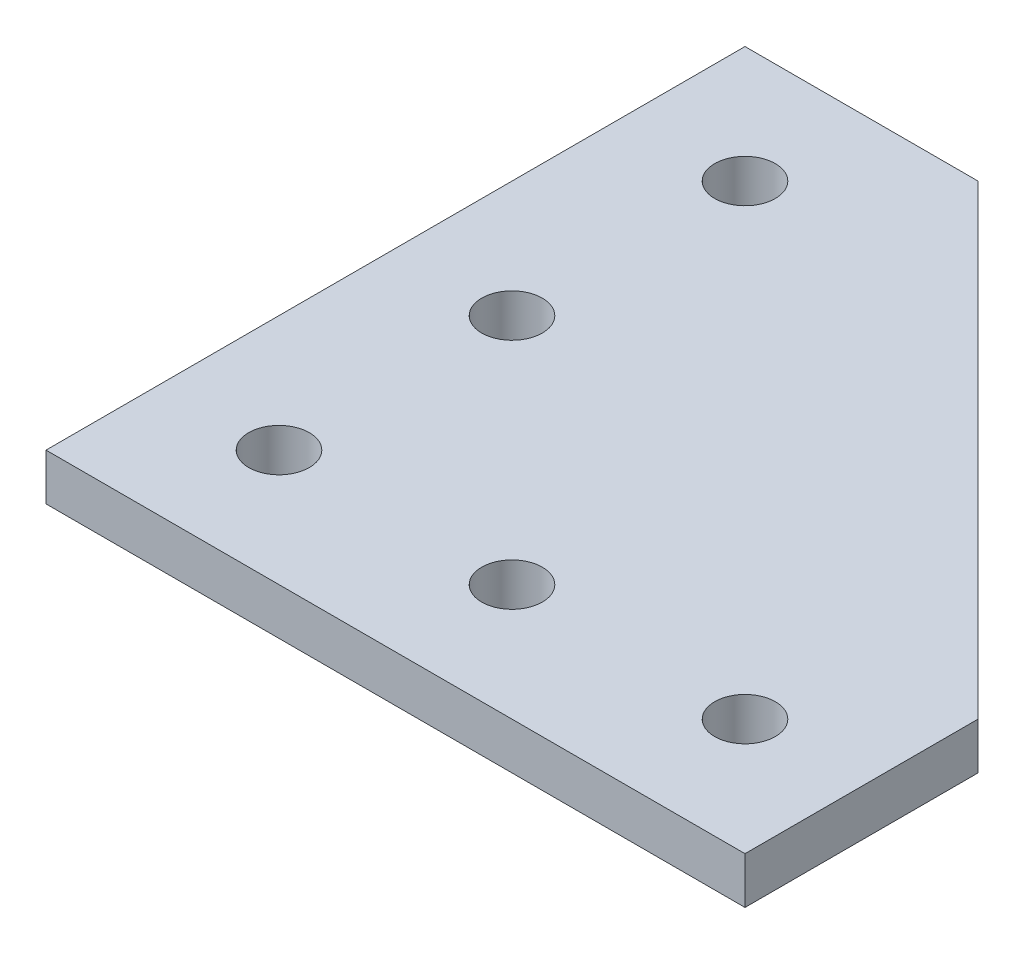
ISO-10303-21;
HEADER;
FILE_DESCRIPTION(('STEP AP214'),'2;1');
FILE_NAME('part.step','',(''),(''),'','','');
FILE_SCHEMA(('AUTOMOTIVE_DESIGN { 1 0 10303 214 1 1 1 1 }'));
ENDSEC;
DATA;
#1=APPLICATION_CONTEXT('core data for automotive mechanical design processes');
#2=APPLICATION_PROTOCOL_DEFINITION('international standard','automotive_design',2000,#1);
#3=PRODUCT_CONTEXT('',#1,'mechanical');
#4=PRODUCT('Part','Part','',(#3));
#5=PRODUCT_RELATED_PRODUCT_CATEGORY('part','',(#4));
#6=PRODUCT_DEFINITION_FORMATION('','',#4);
#7=PRODUCT_DEFINITION_CONTEXT('part definition',#1,'design');
#8=PRODUCT_DEFINITION('design','',#6,#7);
#9=PRODUCT_DEFINITION_SHAPE('','',#8);
#10=(LENGTH_UNIT() NAMED_UNIT(*) SI_UNIT(.MILLI.,.METRE.));
#11=(NAMED_UNIT(*) PLANE_ANGLE_UNIT() SI_UNIT($,.RADIAN.));
#12=(NAMED_UNIT(*) SI_UNIT($,.STERADIAN.) SOLID_ANGLE_UNIT());
#13=UNCERTAINTY_MEASURE_WITH_UNIT(LENGTH_MEASURE(1.E-05),#10,'distance_accuracy_value','');
#14=(GEOMETRIC_REPRESENTATION_CONTEXT(3) GLOBAL_UNCERTAINTY_ASSIGNED_CONTEXT((#13)) GLOBAL_UNIT_ASSIGNED_CONTEXT((#10,
#11,#12)) REPRESENTATION_CONTEXT('',''));
#15=CARTESIAN_POINT('',(0.,0.,0.));
#16=DIRECTION('',(0.,0.,1.));
#17=DIRECTION('',(1.,0.,0.));
#18=AXIS2_PLACEMENT_3D('',#15,#16,#17);
#19=CARTESIAN_POINT('',(0.,4.,0.));
#20=DIRECTION('',(0.,1.,0.));
#21=DIRECTION('',(0.,0.,1.));
#22=AXIS2_PLACEMENT_3D('',#19,#20,#21);
#23=PLANE('',#22);
#24=CARTESIAN_POINT('',(10.,4.,-30.));
#25=DIRECTION('',(0.,1.,0.));
#26=DIRECTION('',(0.,0.,1.));
#27=AXIS2_PLACEMENT_3D('',#24,#25,#26);
#28=CIRCLE('',#27,2.6);
#29=CARTESIAN_POINT('',(10.,4.,-27.4));
#30=VERTEX_POINT('',#29);
#31=EDGE_CURVE('E176',#30,#30,#28,.T.);
#32=ORIENTED_EDGE('',*,*,#31,.F.);
#33=EDGE_LOOP('',(#32));
#34=FACE_BOUND('',#33,.T.);
#35=CARTESIAN_POINT('',(30.,4.,-10.));
#36=DIRECTION('',(0.,1.,0.));
#37=DIRECTION('',(0.,0.,1.));
#38=AXIS2_PLACEMENT_3D('',#35,#36,#37);
#39=CIRCLE('',#38,2.6);
#40=CARTESIAN_POINT('',(30.,4.,-7.40000000000001));
#41=VERTEX_POINT('',#40);
#42=EDGE_CURVE('E188',#41,#41,#39,.T.);
#43=ORIENTED_EDGE('',*,*,#42,.F.);
#44=EDGE_LOOP('',(#43));
#45=FACE_BOUND('',#44,.T.);
#46=DIRECTION('',(0.,0.,1.));
#47=VECTOR('',#46,1.);
#48=CARTESIAN_POINT('',(0.,4.,-60.));
#49=LINE('',#48,#47);
#50=CARTESIAN_POINT('',(0.,4.,-60.));
#51=VERTEX_POINT('',#50);
#52=CARTESIAN_POINT('',(0.,4.,0.));
#53=VERTEX_POINT('',#52);
#54=EDGE_CURVE('E117',#51,#53,#49,.T.);
#55=ORIENTED_EDGE('',*,*,#54,.T.);
#56=DIRECTION('',(1.,0.,0.));
#57=VECTOR('',#56,1.);
#58=CARTESIAN_POINT('',(0.,4.,0.));
#59=LINE('',#58,#57);
#60=CARTESIAN_POINT('',(60.,4.,0.));
#61=VERTEX_POINT('',#60);
#62=EDGE_CURVE('E84',#53,#61,#59,.T.);
#63=ORIENTED_EDGE('',*,*,#62,.T.);
#64=DIRECTION('',(0.,0.,-1.));
#65=VECTOR('',#64,1.);
#66=CARTESIAN_POINT('',(60.,4.,0.));
#67=LINE('',#66,#65);
#68=CARTESIAN_POINT('',(60.,4.,-20.));
#69=VERTEX_POINT('',#68);
#70=EDGE_CURVE('E88',#61,#69,#67,.T.);
#71=ORIENTED_EDGE('',*,*,#70,.T.);
#72=DIRECTION('',(-0.707106781186548,0.,-0.707106781186548));
#73=VECTOR('',#72,1.);
#74=CARTESIAN_POINT('',(60.,4.,-20.));
#75=LINE('',#74,#73);
#76=CARTESIAN_POINT('',(20.,4.,-60.));
#77=VERTEX_POINT('',#76);
#78=EDGE_CURVE('E92',#69,#77,#75,.T.);
#79=ORIENTED_EDGE('',*,*,#78,.T.);
#80=DIRECTION('',(-1.,0.,0.));
#81=VECTOR('',#80,1.);
#82=CARTESIAN_POINT('',(20.,4.,-60.));
#83=LINE('',#82,#81);
#84=EDGE_CURVE('E50',#77,#51,#83,.T.);
#85=ORIENTED_EDGE('',*,*,#84,.T.);
#86=EDGE_LOOP('',(#55,#63,#71,#79,#85));
#87=FACE_BOUND('',#86,.T.);
#88=CARTESIAN_POINT('',(10.,4.,-10.));
#89=DIRECTION('',(0.,1.,0.));
#90=DIRECTION('',(0.,0.,1.));
#91=AXIS2_PLACEMENT_3D('',#88,#89,#90);
#92=CIRCLE('',#91,2.6);
#93=CARTESIAN_POINT('',(10.,4.,-7.4));
#94=VERTEX_POINT('',#93);
#95=EDGE_CURVE('E112',#94,#94,#92,.T.);
#96=ORIENTED_EDGE('',*,*,#95,.F.);
#97=EDGE_LOOP('',(#96));
#98=FACE_BOUND('',#97,.T.);
#99=CARTESIAN_POINT('',(50.,4.,-10.));
#100=DIRECTION('',(0.,1.,0.));
#101=DIRECTION('',(0.,0.,1.));
#102=AXIS2_PLACEMENT_3D('',#99,#100,#101);
#103=CIRCLE('',#102,2.6);
#104=CARTESIAN_POINT('',(50.,4.,-7.40000000000002));
#105=VERTEX_POINT('',#104);
#106=EDGE_CURVE('E182',#105,#105,#103,.T.);
#107=ORIENTED_EDGE('',*,*,#106,.F.);
#108=EDGE_LOOP('',(#107));
#109=FACE_BOUND('',#108,.T.);
#110=CARTESIAN_POINT('',(9.99999999999998,4.,-50.));
#111=DIRECTION('',(0.,1.,0.));
#112=DIRECTION('',(0.,0.,1.));
#113=AXIS2_PLACEMENT_3D('',#110,#111,#112);
#114=CIRCLE('',#113,2.6);
#115=CARTESIAN_POINT('',(9.99999999999998,4.,-47.4));
#116=VERTEX_POINT('',#115);
#117=EDGE_CURVE('E167',#116,#116,#114,.T.);
#118=ORIENTED_EDGE('',*,*,#117,.F.);
#119=EDGE_LOOP('',(#118));
#120=FACE_BOUND('',#119,.T.);
#121=ADVANCED_FACE('F33',(#34,#45,#87,#98,#109,#120),#23,.T.);
#122=CARTESIAN_POINT('',(0.,0.,0.));
#123=DIRECTION('',(0.,1.,0.));
#124=DIRECTION('',(0.,0.,1.));
#125=AXIS2_PLACEMENT_3D('',#122,#123,#124);
#126=PLANE('',#125);
#127=DIRECTION('',(0.,0.,1.));
#128=VECTOR('',#127,1.);
#129=CARTESIAN_POINT('',(0.,0.,-60.));
#130=LINE('',#129,#128);
#131=CARTESIAN_POINT('',(0.,0.,-60.));
#132=VERTEX_POINT('',#131);
#133=CARTESIAN_POINT('',(0.,0.,0.));
#134=VERTEX_POINT('',#133);
#135=EDGE_CURVE('E108',#132,#134,#130,.T.);
#136=ORIENTED_EDGE('',*,*,#135,.F.);
#137=DIRECTION('',(-1.,0.,0.));
#138=VECTOR('',#137,1.);
#139=CARTESIAN_POINT('',(20.,0.,-60.));
#140=LINE('',#139,#138);
#141=CARTESIAN_POINT('',(20.,0.,-60.));
#142=VERTEX_POINT('',#141);
#143=EDGE_CURVE('E76',#142,#132,#140,.T.);
#144=ORIENTED_EDGE('',*,*,#143,.F.);
#145=DIRECTION('',(-0.707106781186548,0.,-0.707106781186548));
#146=VECTOR('',#145,1.);
#147=CARTESIAN_POINT('',(60.,0.,-20.));
#148=LINE('',#147,#146);
#149=CARTESIAN_POINT('',(60.,0.,-20.));
#150=VERTEX_POINT('',#149);
#151=EDGE_CURVE('E70',#150,#142,#148,.T.);
#152=ORIENTED_EDGE('',*,*,#151,.F.);
#153=DIRECTION('',(0.,0.,-1.));
#154=VECTOR('',#153,1.);
#155=CARTESIAN_POINT('',(60.,0.,0.));
#156=LINE('',#155,#154);
#157=CARTESIAN_POINT('',(60.,0.,0.));
#158=VERTEX_POINT('',#157);
#159=EDGE_CURVE('E99',#158,#150,#156,.T.);
#160=ORIENTED_EDGE('',*,*,#159,.F.);
#161=DIRECTION('',(1.,0.,0.));
#162=VECTOR('',#161,1.);
#163=CARTESIAN_POINT('',(0.,0.,0.));
#164=LINE('',#163,#162);
#165=EDGE_CURVE('E111',#134,#158,#164,.T.);
#166=ORIENTED_EDGE('',*,*,#165,.F.);
#167=EDGE_LOOP('',(#136,#144,#152,#160,#166));
#168=FACE_BOUND('',#167,.T.);
#169=CARTESIAN_POINT('',(10.,0.,-10.));
#170=DIRECTION('',(0.,1.,0.));
#171=DIRECTION('',(0.,0.,1.));
#172=AXIS2_PLACEMENT_3D('',#169,#170,#171);
#173=CIRCLE('',#172,2.6);
#174=CARTESIAN_POINT('',(10.,0.,-7.4));
#175=VERTEX_POINT('',#174);
#176=EDGE_CURVE('E191',#175,#175,#173,.T.);
#177=ORIENTED_EDGE('',*,*,#176,.T.);
#178=EDGE_LOOP('',(#177));
#179=FACE_BOUND('',#178,.T.);
#180=CARTESIAN_POINT('',(30.,0.,-10.));
#181=DIRECTION('',(0.,1.,0.));
#182=DIRECTION('',(0.,0.,1.));
#183=AXIS2_PLACEMENT_3D('',#180,#181,#182);
#184=CIRCLE('',#183,2.6);
#185=CARTESIAN_POINT('',(30.,0.,-7.40000000000001));
#186=VERTEX_POINT('',#185);
#187=EDGE_CURVE('E185',#186,#186,#184,.T.);
#188=ORIENTED_EDGE('',*,*,#187,.T.);
#189=EDGE_LOOP('',(#188));
#190=FACE_BOUND('',#189,.T.);
#191=CARTESIAN_POINT('',(50.,0.,-10.));
#192=DIRECTION('',(0.,1.,0.));
#193=DIRECTION('',(0.,0.,1.));
#194=AXIS2_PLACEMENT_3D('',#191,#192,#193);
#195=CIRCLE('',#194,2.6);
#196=CARTESIAN_POINT('',(50.,0.,-7.40000000000002));
#197=VERTEX_POINT('',#196);
#198=EDGE_CURVE('E179',#197,#197,#195,.T.);
#199=ORIENTED_EDGE('',*,*,#198,.T.);
#200=EDGE_LOOP('',(#199));
#201=FACE_BOUND('',#200,.T.);
#202=CARTESIAN_POINT('',(10.,0.,-30.));
#203=DIRECTION('',(0.,1.,0.));
#204=DIRECTION('',(0.,0.,1.));
#205=AXIS2_PLACEMENT_3D('',#202,#203,#204);
#206=CIRCLE('',#205,2.6);
#207=CARTESIAN_POINT('',(10.,0.,-27.4));
#208=VERTEX_POINT('',#207);
#209=EDGE_CURVE('E173',#208,#208,#206,.T.);
#210=ORIENTED_EDGE('',*,*,#209,.T.);
#211=EDGE_LOOP('',(#210));
#212=FACE_BOUND('',#211,.T.);
#213=CARTESIAN_POINT('',(9.99999999999998,0.,-50.));
#214=DIRECTION('',(0.,1.,0.));
#215=DIRECTION('',(0.,0.,1.));
#216=AXIS2_PLACEMENT_3D('',#213,#214,#215);
#217=CIRCLE('',#216,2.6);
#218=CARTESIAN_POINT('',(9.99999999999998,0.,-47.4));
#219=VERTEX_POINT('',#218);
#220=EDGE_CURVE('E170',#219,#219,#217,.T.);
#221=ORIENTED_EDGE('',*,*,#220,.T.);
#222=EDGE_LOOP('',(#221));
#223=FACE_BOUND('',#222,.T.);
#224=ADVANCED_FACE('F121',(#168,#179,#190,#201,#212,#223),#126,.F.);
#225=CARTESIAN_POINT('',(0.,4.,-60.));
#226=DIRECTION('',(1.,0.,0.));
#227=DIRECTION('',(0.,0.,-1.));
#228=AXIS2_PLACEMENT_3D('',#225,#226,#227);
#229=PLANE('',#228);
#230=ORIENTED_EDGE('',*,*,#135,.T.);
#231=DIRECTION('',(0.,-1.,0.));
#232=VECTOR('',#231,1.);
#233=CARTESIAN_POINT('',(0.,4.,0.));
#234=LINE('',#233,#232);
#235=EDGE_CURVE('E11',#53,#134,#234,.T.);
#236=ORIENTED_EDGE('',*,*,#235,.F.);
#237=ORIENTED_EDGE('',*,*,#54,.F.);
#238=DIRECTION('',(0.,-1.,0.));
#239=VECTOR('',#238,1.);
#240=CARTESIAN_POINT('',(0.,4.,-60.));
#241=LINE('',#240,#239);
#242=EDGE_CURVE('E104',#51,#132,#241,.T.);
#243=ORIENTED_EDGE('',*,*,#242,.T.);
#244=EDGE_LOOP('',(#230,#236,#237,#243));
#245=FACE_BOUND('',#244,.T.);
#246=ADVANCED_FACE('F35',(#245),#229,.F.);
#247=CARTESIAN_POINT('',(0.,4.,0.));
#248=DIRECTION('',(0.,0.,-1.));
#249=DIRECTION('',(-1.,0.,0.));
#250=AXIS2_PLACEMENT_3D('',#247,#248,#249);
#251=PLANE('',#250);
#252=ORIENTED_EDGE('',*,*,#165,.T.);
#253=DIRECTION('',(0.,-1.,0.));
#254=VECTOR('',#253,1.);
#255=CARTESIAN_POINT('',(60.,4.,0.));
#256=LINE('',#255,#254);
#257=EDGE_CURVE('E42',#61,#158,#256,.T.);
#258=ORIENTED_EDGE('',*,*,#257,.F.);
#259=ORIENTED_EDGE('',*,*,#62,.F.);
#260=ORIENTED_EDGE('',*,*,#235,.T.);
#261=EDGE_LOOP('',(#252,#258,#259,#260));
#262=FACE_BOUND('',#261,.T.);
#263=ADVANCED_FACE('F249',(#262),#251,.F.);
#264=CARTESIAN_POINT('',(60.,4.,0.));
#265=DIRECTION('',(-1.,0.,0.));
#266=DIRECTION('',(0.,0.,1.));
#267=AXIS2_PLACEMENT_3D('',#264,#265,#266);
#268=PLANE('',#267);
#269=ORIENTED_EDGE('',*,*,#159,.T.);
#270=DIRECTION('',(0.,-1.,0.));
#271=VECTOR('',#270,1.);
#272=CARTESIAN_POINT('',(60.,4.,-20.));
#273=LINE('',#272,#271);
#274=EDGE_CURVE('E96',#69,#150,#273,.T.);
#275=ORIENTED_EDGE('',*,*,#274,.F.);
#276=ORIENTED_EDGE('',*,*,#70,.F.);
#277=ORIENTED_EDGE('',*,*,#257,.T.);
#278=EDGE_LOOP('',(#269,#275,#276,#277));
#279=FACE_BOUND('',#278,.T.);
#280=ADVANCED_FACE('F97',(#279),#268,.F.);
#281=CARTESIAN_POINT('',(60.,4.,-20.));
#282=DIRECTION('',(-0.707106781186547,0.,0.707106781186547));
#283=DIRECTION('',(0.707106781186548,0.,0.707106781186548));
#284=AXIS2_PLACEMENT_3D('',#281,#282,#283);
#285=PLANE('',#284);
#286=ORIENTED_EDGE('',*,*,#151,.T.);
#287=DIRECTION('',(0.,-1.,0.));
#288=VECTOR('',#287,1.);
#289=CARTESIAN_POINT('',(20.,4.,-60.));
#290=LINE('',#289,#288);
#291=EDGE_CURVE('E100',#77,#142,#290,.T.);
#292=ORIENTED_EDGE('',*,*,#291,.F.);
#293=ORIENTED_EDGE('',*,*,#78,.F.);
#294=ORIENTED_EDGE('',*,*,#274,.T.);
#295=EDGE_LOOP('',(#286,#292,#293,#294));
#296=FACE_BOUND('',#295,.T.);
#297=ADVANCED_FACE('F102',(#296),#285,.F.);
#298=CARTESIAN_POINT('',(20.,4.,-60.));
#299=DIRECTION('',(0.,0.,1.));
#300=DIRECTION('',(1.,0.,0.));
#301=AXIS2_PLACEMENT_3D('',#298,#299,#300);
#302=PLANE('',#301);
#303=ORIENTED_EDGE('',*,*,#143,.T.);
#304=ORIENTED_EDGE('',*,*,#242,.F.);
#305=ORIENTED_EDGE('',*,*,#84,.F.);
#306=ORIENTED_EDGE('',*,*,#291,.T.);
#307=EDGE_LOOP('',(#303,#304,#305,#306));
#308=FACE_BOUND('',#307,.T.);
#309=ADVANCED_FACE('F126',(#308),#302,.F.);
#310=CARTESIAN_POINT('',(10.,4.,-10.));
#311=DIRECTION('',(0.,-1.,0.));
#312=DIRECTION('',(0.,0.,-1.));
#313=AXIS2_PLACEMENT_3D('',#310,#311,#312);
#314=CYLINDRICAL_SURFACE('',#313,2.6);
#315=ORIENTED_EDGE('',*,*,#95,.T.);
#316=EDGE_LOOP('',(#315));
#317=FACE_BOUND('',#316,.T.);
#318=ORIENTED_EDGE('',*,*,#176,.F.);
#319=EDGE_LOOP('',(#318));
#320=FACE_BOUND('',#319,.T.);
#321=ADVANCED_FACE('F128',(#317,#320),#314,.F.);
#322=CARTESIAN_POINT('',(30.,4.,-10.));
#323=DIRECTION('',(0.,-1.,0.));
#324=DIRECTION('',(0.,0.,-1.));
#325=AXIS2_PLACEMENT_3D('',#322,#323,#324);
#326=CYLINDRICAL_SURFACE('',#325,2.6);
#327=ORIENTED_EDGE('',*,*,#42,.T.);
#328=EDGE_LOOP('',(#327));
#329=FACE_BOUND('',#328,.T.);
#330=ORIENTED_EDGE('',*,*,#187,.F.);
#331=EDGE_LOOP('',(#330));
#332=FACE_BOUND('',#331,.T.);
#333=ADVANCED_FACE('F134',(#329,#332),#326,.F.);
#334=CARTESIAN_POINT('',(50.,4.,-10.));
#335=DIRECTION('',(0.,-1.,0.));
#336=DIRECTION('',(0.,0.,-1.));
#337=AXIS2_PLACEMENT_3D('',#334,#335,#336);
#338=CYLINDRICAL_SURFACE('',#337,2.6);
#339=ORIENTED_EDGE('',*,*,#106,.T.);
#340=EDGE_LOOP('',(#339));
#341=FACE_BOUND('',#340,.T.);
#342=ORIENTED_EDGE('',*,*,#198,.F.);
#343=EDGE_LOOP('',(#342));
#344=FACE_BOUND('',#343,.T.);
#345=ADVANCED_FACE('F150',(#341,#344),#338,.F.);
#346=CARTESIAN_POINT('',(10.,4.,-30.));
#347=DIRECTION('',(0.,-1.,0.));
#348=DIRECTION('',(0.,0.,-1.));
#349=AXIS2_PLACEMENT_3D('',#346,#347,#348);
#350=CYLINDRICAL_SURFACE('',#349,2.6);
#351=ORIENTED_EDGE('',*,*,#31,.T.);
#352=EDGE_LOOP('',(#351));
#353=FACE_BOUND('',#352,.T.);
#354=ORIENTED_EDGE('',*,*,#209,.F.);
#355=EDGE_LOOP('',(#354));
#356=FACE_BOUND('',#355,.T.);
#357=ADVANCED_FACE('F154',(#353,#356),#350,.F.);
#358=CARTESIAN_POINT('',(9.99999999999998,4.,-50.));
#359=DIRECTION('',(0.,-1.,0.));
#360=DIRECTION('',(0.,0.,-1.));
#361=AXIS2_PLACEMENT_3D('',#358,#359,#360);
#362=CYLINDRICAL_SURFACE('',#361,2.6);
#363=ORIENTED_EDGE('',*,*,#117,.T.);
#364=EDGE_LOOP('',(#363));
#365=FACE_BOUND('',#364,.T.);
#366=ORIENTED_EDGE('',*,*,#220,.F.);
#367=EDGE_LOOP('',(#366));
#368=FACE_BOUND('',#367,.T.);
#369=ADVANCED_FACE('F158',(#365,#368),#362,.F.);
#370=CLOSED_SHELL('',(#121,#224,#246,#263,#280,#297,#309,#321,#333,#345,#357,#369));
#371=MANIFOLD_SOLID_BREP('B2',#370);
#372=ADVANCED_BREP_SHAPE_REPRESENTATION('',(#18,#371),#14);
#373=SHAPE_DEFINITION_REPRESENTATION(#9,#372);
ENDSEC;
END-ISO-10303-21;
